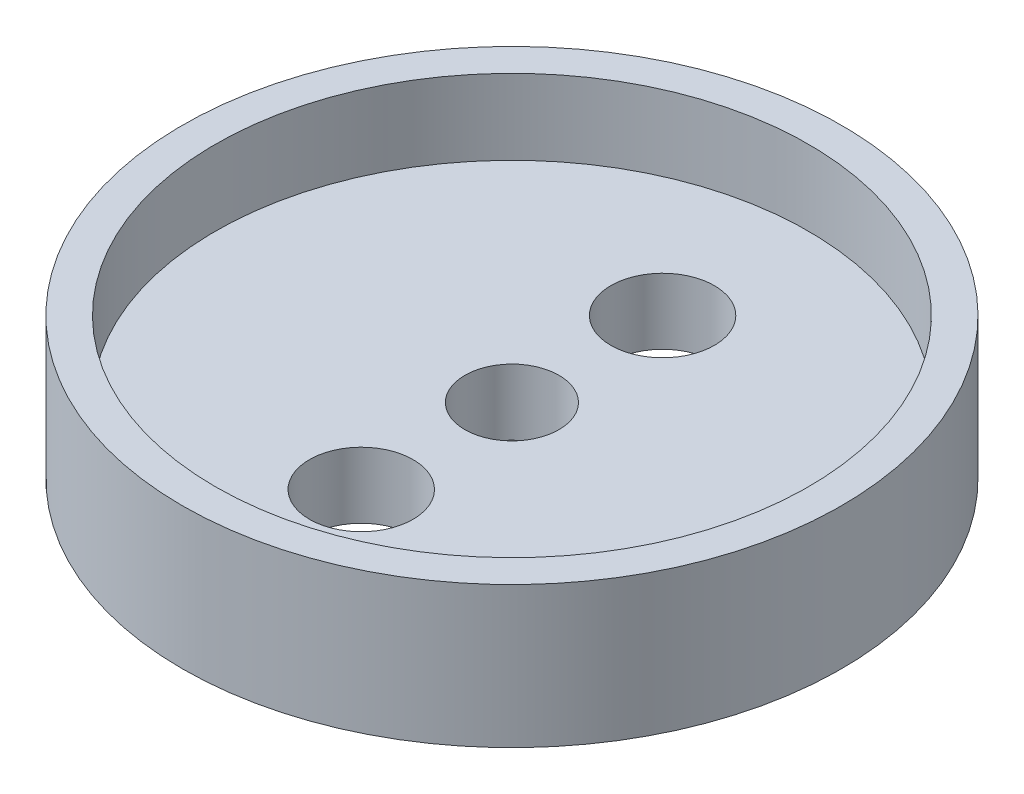
ISO-10303-21;
HEADER;
FILE_DESCRIPTION(('STEP AP214'),'2;1');
FILE_NAME('part.step','',(''),(''),'','','');
FILE_SCHEMA(('AUTOMOTIVE_DESIGN { 1 0 10303 214 1 1 1 1 }'));
ENDSEC;
DATA;
#1=APPLICATION_CONTEXT('core data for automotive mechanical design processes');
#2=APPLICATION_PROTOCOL_DEFINITION('international standard','automotive_design',2000,#1);
#3=PRODUCT_CONTEXT('',#1,'mechanical');
#4=PRODUCT('Part','Part','',(#3));
#5=PRODUCT_RELATED_PRODUCT_CATEGORY('part','',(#4));
#6=PRODUCT_DEFINITION_FORMATION('','',#4);
#7=PRODUCT_DEFINITION_CONTEXT('part definition',#1,'design');
#8=PRODUCT_DEFINITION('design','',#6,#7);
#9=PRODUCT_DEFINITION_SHAPE('','',#8);
#10=(LENGTH_UNIT() NAMED_UNIT(*) SI_UNIT(.MILLI.,.METRE.));
#11=(NAMED_UNIT(*) PLANE_ANGLE_UNIT() SI_UNIT($,.RADIAN.));
#12=(NAMED_UNIT(*) SI_UNIT($,.STERADIAN.) SOLID_ANGLE_UNIT());
#13=UNCERTAINTY_MEASURE_WITH_UNIT(LENGTH_MEASURE(1.E-05),#10,'distance_accuracy_value','');
#14=(GEOMETRIC_REPRESENTATION_CONTEXT(3) GLOBAL_UNCERTAINTY_ASSIGNED_CONTEXT((#13)) GLOBAL_UNIT_ASSIGNED_CONTEXT((#10,
#11,#12)) REPRESENTATION_CONTEXT('',''));
#15=CARTESIAN_POINT('',(0.,0.,0.));
#16=DIRECTION('',(0.,0.,1.));
#17=DIRECTION('',(1.,0.,0.));
#18=AXIS2_PLACEMENT_3D('',#15,#16,#17);
#19=CARTESIAN_POINT('',(0.,7.5,8.));
#20=DIRECTION('',(0.,-1.,0.));
#21=DIRECTION('',(0.,0.,-1.));
#22=AXIS2_PLACEMENT_3D('',#19,#20,#21);
#23=CYLINDRICAL_SURFACE('',#22,2.75);
#24=CARTESIAN_POINT('',(0.,0.,8.));
#25=DIRECTION('',(0.,1.,0.));
#26=DIRECTION('',(0.,0.,1.));
#27=AXIS2_PLACEMENT_3D('',#24,#25,#26);
#28=CIRCLE('',#27,2.75);
#29=CARTESIAN_POINT('',(0.,0.,10.75));
#30=VERTEX_POINT('',#29);
#31=EDGE_CURVE('E58',#30,#30,#28,.T.);
#32=ORIENTED_EDGE('',*,*,#31,.F.);
#33=EDGE_LOOP('',(#32));
#34=FACE_BOUND('',#33,.T.);
#35=CARTESIAN_POINT('',(0.,3.5,8.));
#36=DIRECTION('',(0.,1.,0.));
#37=DIRECTION('',(0.,0.,1.));
#38=AXIS2_PLACEMENT_3D('',#35,#36,#37);
#39=CIRCLE('',#38,2.75);
#40=CARTESIAN_POINT('',(0.,3.5,10.75));
#41=VERTEX_POINT('',#40);
#42=EDGE_CURVE('E71',#41,#41,#39,.T.);
#43=ORIENTED_EDGE('',*,*,#42,.T.);
#44=EDGE_LOOP('',(#43));
#45=FACE_BOUND('',#44,.T.);
#46=ADVANCED_FACE('F43',(#34,#45),#23,.F.);
#47=CARTESIAN_POINT('',(0.,7.5,-8.));
#48=DIRECTION('',(0.,-1.,0.));
#49=DIRECTION('',(0.,0.,-1.));
#50=AXIS2_PLACEMENT_3D('',#47,#48,#49);
#51=CYLINDRICAL_SURFACE('',#50,2.75);
#52=CARTESIAN_POINT('',(0.,0.,-8.));
#53=DIRECTION('',(0.,1.,0.));
#54=DIRECTION('',(0.,0.,1.));
#55=AXIS2_PLACEMENT_3D('',#52,#53,#54);
#56=CIRCLE('',#55,2.75);
#57=CARTESIAN_POINT('',(0.,0.,-5.25));
#58=VERTEX_POINT('',#57);
#59=EDGE_CURVE('E63',#58,#58,#56,.T.);
#60=ORIENTED_EDGE('',*,*,#59,.F.);
#61=EDGE_LOOP('',(#60));
#62=FACE_BOUND('',#61,.T.);
#63=CARTESIAN_POINT('',(0.,3.5,-8.));
#64=DIRECTION('',(0.,1.,0.));
#65=DIRECTION('',(0.,0.,1.));
#66=AXIS2_PLACEMENT_3D('',#63,#64,#65);
#67=CIRCLE('',#66,2.75);
#68=CARTESIAN_POINT('',(0.,3.5,-5.25));
#69=VERTEX_POINT('',#68);
#70=EDGE_CURVE('E75',#69,#69,#67,.T.);
#71=ORIENTED_EDGE('',*,*,#70,.T.);
#72=EDGE_LOOP('',(#71));
#73=FACE_BOUND('',#72,.T.);
#74=ADVANCED_FACE('F107',(#62,#73),#51,.F.);
#75=CARTESIAN_POINT('',(0.,7.5,0.));
#76=DIRECTION('',(0.,-1.,0.));
#77=DIRECTION('',(0.,0.,-1.));
#78=AXIS2_PLACEMENT_3D('',#75,#76,#77);
#79=CYLINDRICAL_SURFACE('',#78,2.5);
#80=CARTESIAN_POINT('',(0.,0.,0.));
#81=DIRECTION('',(0.,1.,0.));
#82=DIRECTION('',(0.,0.,1.));
#83=AXIS2_PLACEMENT_3D('',#80,#81,#82);
#84=CIRCLE('',#83,2.5);
#85=CARTESIAN_POINT('',(0.,0.,2.5));
#86=VERTEX_POINT('',#85);
#87=EDGE_CURVE('E67',#86,#86,#84,.T.);
#88=ORIENTED_EDGE('',*,*,#87,.F.);
#89=EDGE_LOOP('',(#88));
#90=FACE_BOUND('',#89,.T.);
#91=CARTESIAN_POINT('',(0.,3.5,0.));
#92=DIRECTION('',(0.,1.,0.));
#93=DIRECTION('',(0.,0.,1.));
#94=AXIS2_PLACEMENT_3D('',#91,#92,#93);
#95=CIRCLE('',#94,2.5);
#96=CARTESIAN_POINT('',(0.,3.5,2.5));
#97=VERTEX_POINT('',#96);
#98=EDGE_CURVE('E47',#97,#97,#95,.T.);
#99=ORIENTED_EDGE('',*,*,#98,.T.);
#100=EDGE_LOOP('',(#99));
#101=FACE_BOUND('',#100,.T.);
#102=ADVANCED_FACE('F92',(#90,#101),#79,.F.);
#103=CARTESIAN_POINT('',(0.,7.5,0.));
#104=DIRECTION('',(0.,1.,0.));
#105=DIRECTION('',(0.,0.,1.));
#106=AXIS2_PLACEMENT_3D('',#103,#104,#105);
#107=PLANE('',#106);
#108=CARTESIAN_POINT('',(0.,7.5,0.));
#109=DIRECTION('',(0.,1.,0.));
#110=DIRECTION('',(0.,0.,1.));
#111=AXIS2_PLACEMENT_3D('',#108,#109,#110);
#112=CIRCLE('',#111,15.75);
#113=CARTESIAN_POINT('',(0.,7.5,15.75));
#114=VERTEX_POINT('',#113);
#115=EDGE_CURVE('E79',#114,#114,#112,.T.);
#116=ORIENTED_EDGE('',*,*,#115,.F.);
#117=EDGE_LOOP('',(#116));
#118=FACE_BOUND('',#117,.T.);
#119=CARTESIAN_POINT('',(0.,7.5,0.));
#120=DIRECTION('',(0.,1.,0.));
#121=DIRECTION('',(0.,0.,1.));
#122=AXIS2_PLACEMENT_3D('',#119,#120,#121);
#123=CIRCLE('',#122,17.5);
#124=CARTESIAN_POINT('',(0.,7.5,17.5));
#125=VERTEX_POINT('',#124);
#126=EDGE_CURVE('E10',#125,#125,#123,.T.);
#127=ORIENTED_EDGE('',*,*,#126,.T.);
#128=EDGE_LOOP('',(#127));
#129=FACE_BOUND('',#128,.T.);
#130=ADVANCED_FACE('F120',(#118,#129),#107,.T.);
#131=CARTESIAN_POINT('',(0.,0.,0.));
#132=DIRECTION('',(0.,1.,0.));
#133=DIRECTION('',(0.,0.,1.));
#134=AXIS2_PLACEMENT_3D('',#131,#132,#133);
#135=PLANE('',#134);
#136=CARTESIAN_POINT('',(0.,0.,0.));
#137=DIRECTION('',(0.,1.,0.));
#138=DIRECTION('',(0.,0.,1.));
#139=AXIS2_PLACEMENT_3D('',#136,#137,#138);
#140=CIRCLE('',#139,17.5);
#141=CARTESIAN_POINT('',(0.,0.,17.5));
#142=VERTEX_POINT('',#141);
#143=EDGE_CURVE('E52',#142,#142,#140,.T.);
#144=ORIENTED_EDGE('',*,*,#143,.F.);
#145=EDGE_LOOP('',(#144));
#146=FACE_BOUND('',#145,.T.);
#147=ORIENTED_EDGE('',*,*,#31,.T.);
#148=EDGE_LOOP('',(#147));
#149=FACE_BOUND('',#148,.T.);
#150=ORIENTED_EDGE('',*,*,#59,.T.);
#151=EDGE_LOOP('',(#150));
#152=FACE_BOUND('',#151,.T.);
#153=ORIENTED_EDGE('',*,*,#87,.T.);
#154=EDGE_LOOP('',(#153));
#155=FACE_BOUND('',#154,.T.);
#156=ADVANCED_FACE('F122',(#146,#149,#152,#155),#135,.F.);
#157=CARTESIAN_POINT('',(0.,7.5,0.));
#158=DIRECTION('',(0.,-1.,0.));
#159=DIRECTION('',(0.,0.,-1.));
#160=AXIS2_PLACEMENT_3D('',#157,#158,#159);
#161=CYLINDRICAL_SURFACE('',#160,17.5);
#162=ORIENTED_EDGE('',*,*,#126,.F.);
#163=EDGE_LOOP('',(#162));
#164=FACE_BOUND('',#163,.T.);
#165=ORIENTED_EDGE('',*,*,#143,.T.);
#166=EDGE_LOOP('',(#165));
#167=FACE_BOUND('',#166,.T.);
#168=ADVANCED_FACE('F45',(#164,#167),#161,.T.);
#169=CARTESIAN_POINT('',(0.,3.5,0.));
#170=DIRECTION('',(0.,1.,0.));
#171=DIRECTION('',(0.,0.,1.));
#172=AXIS2_PLACEMENT_3D('',#169,#170,#171);
#173=CYLINDRICAL_SURFACE('',#172,15.75);
#174=CARTESIAN_POINT('',(0.,3.5,0.));
#175=DIRECTION('',(0.,1.,0.));
#176=DIRECTION('',(0.,0.,1.));
#177=AXIS2_PLACEMENT_3D('',#174,#175,#176);
#178=CIRCLE('',#177,15.75);
#179=CARTESIAN_POINT('',(0.,3.5,15.75));
#180=VERTEX_POINT('',#179);
#181=EDGE_CURVE('E83',#180,#180,#178,.T.);
#182=ORIENTED_EDGE('',*,*,#181,.F.);
#183=EDGE_LOOP('',(#182));
#184=FACE_BOUND('',#183,.T.);
#185=ORIENTED_EDGE('',*,*,#115,.T.);
#186=EDGE_LOOP('',(#185));
#187=FACE_BOUND('',#186,.T.);
#188=ADVANCED_FACE('F96',(#184,#187),#173,.F.);
#189=CARTESIAN_POINT('',(0.,3.5,0.));
#190=DIRECTION('',(0.,1.,0.));
#191=DIRECTION('',(0.,0.,1.));
#192=AXIS2_PLACEMENT_3D('',#189,#190,#191);
#193=PLANE('',#192);
#194=ORIENTED_EDGE('',*,*,#42,.F.);
#195=EDGE_LOOP('',(#194));
#196=FACE_BOUND('',#195,.T.);
#197=ORIENTED_EDGE('',*,*,#70,.F.);
#198=EDGE_LOOP('',(#197));
#199=FACE_BOUND('',#198,.T.);
#200=ORIENTED_EDGE('',*,*,#98,.F.);
#201=EDGE_LOOP('',(#200));
#202=FACE_BOUND('',#201,.T.);
#203=ORIENTED_EDGE('',*,*,#181,.T.);
#204=EDGE_LOOP('',(#203));
#205=FACE_BOUND('',#204,.T.);
#206=ADVANCED_FACE('F94',(#196,#199,#202,#205),#193,.T.);
#207=CLOSED_SHELL('',(#46,#74,#102,#130,#156,#168,#188,#206));
#208=MANIFOLD_SOLID_BREP('B2',#207);
#209=ADVANCED_BREP_SHAPE_REPRESENTATION('',(#18,#208),#14);
#210=SHAPE_DEFINITION_REPRESENTATION(#9,#209);
ENDSEC;
END-ISO-10303-21;
